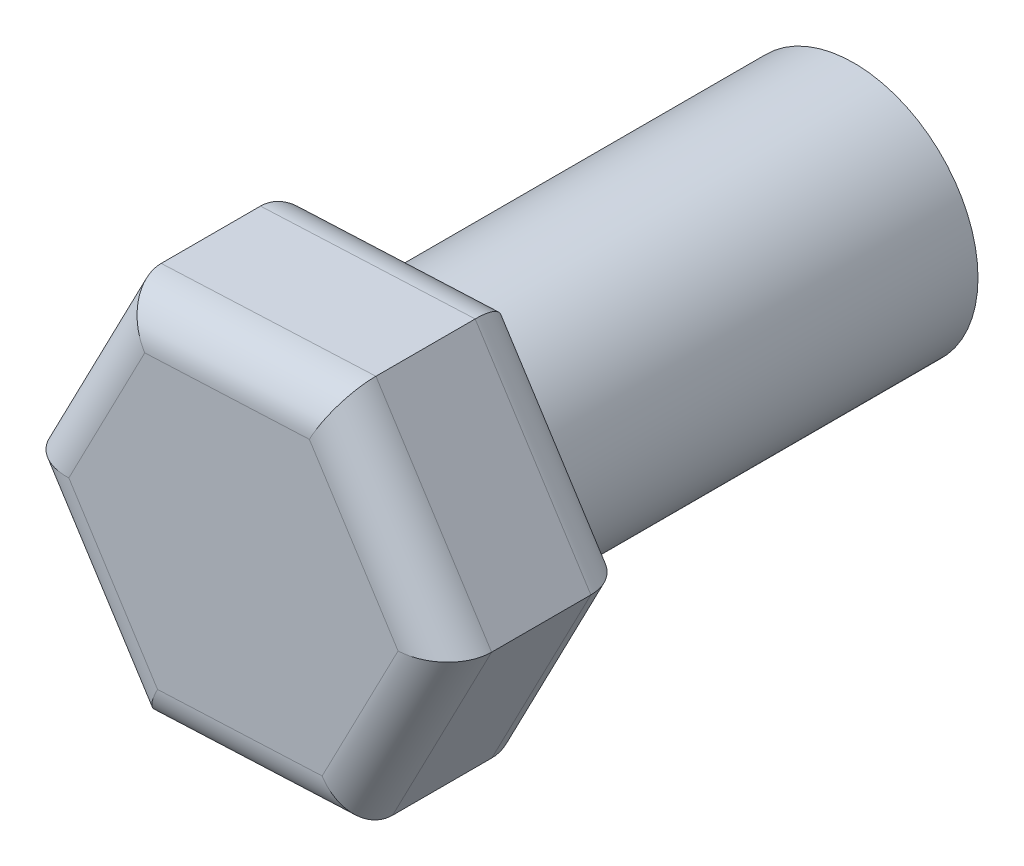
ISO-10303-21;
HEADER;
FILE_DESCRIPTION(('STEP AP214'),'2;1');
FILE_NAME('part.step','',(''),(''),'','','');
FILE_SCHEMA(('AUTOMOTIVE_DESIGN { 1 0 10303 214 1 1 1 1 }'));
ENDSEC;
DATA;
#1=APPLICATION_CONTEXT('core data for automotive mechanical design processes');
#2=APPLICATION_PROTOCOL_DEFINITION('international standard','automotive_design',2000,#1);
#3=PRODUCT_CONTEXT('',#1,'mechanical');
#4=PRODUCT('Part','Part','',(#3));
#5=PRODUCT_RELATED_PRODUCT_CATEGORY('part','',(#4));
#6=PRODUCT_DEFINITION_FORMATION('','',#4);
#7=PRODUCT_DEFINITION_CONTEXT('part definition',#1,'design');
#8=PRODUCT_DEFINITION('design','',#6,#7);
#9=PRODUCT_DEFINITION_SHAPE('','',#8);
#10=(LENGTH_UNIT() NAMED_UNIT(*) SI_UNIT(.MILLI.,.METRE.));
#11=(NAMED_UNIT(*) PLANE_ANGLE_UNIT() SI_UNIT($,.RADIAN.));
#12=(NAMED_UNIT(*) SI_UNIT($,.STERADIAN.) SOLID_ANGLE_UNIT());
#13=UNCERTAINTY_MEASURE_WITH_UNIT(LENGTH_MEASURE(1.E-05),#10,'distance_accuracy_value','');
#14=(GEOMETRIC_REPRESENTATION_CONTEXT(3) GLOBAL_UNCERTAINTY_ASSIGNED_CONTEXT((#13)) GLOBAL_UNIT_ASSIGNED_CONTEXT((#10,
#11,#12)) REPRESENTATION_CONTEXT('',''));
#15=CARTESIAN_POINT('',(0.,0.,0.));
#16=DIRECTION('',(0.,0.,1.));
#17=DIRECTION('',(1.,0.,0.));
#18=AXIS2_PLACEMENT_3D('',#15,#16,#17);
#19=CARTESIAN_POINT('',(0.,0.,7.));
#20=DIRECTION('',(0.,0.,-1.));
#21=DIRECTION('',(-1.,0.,0.));
#22=AXIS2_PLACEMENT_3D('',#19,#20,#21);
#23=CYLINDRICAL_SURFACE('',#22,2.);
#24=CARTESIAN_POINT('',(0.,0.,7.));
#25=DIRECTION('',(0.,0.,1.));
#26=DIRECTION('',(1.,0.,0.));
#27=AXIS2_PLACEMENT_3D('',#24,#25,#26);
#28=CIRCLE('',#27,2.);
#29=CARTESIAN_POINT('',(2.,0.,7.));
#30=VERTEX_POINT('',#29);
#31=EDGE_CURVE('E153',#30,#30,#28,.T.);
#32=ORIENTED_EDGE('',*,*,#31,.F.);
#33=EDGE_LOOP('',(#32));
#34=FACE_BOUND('',#33,.T.);
#35=CARTESIAN_POINT('',(0.,0.,0.));
#36=DIRECTION('',(0.,0.,1.));
#37=DIRECTION('',(1.,0.,0.));
#38=AXIS2_PLACEMENT_3D('',#35,#36,#37);
#39=CIRCLE('',#38,2.);
#40=CARTESIAN_POINT('',(2.,0.,0.));
#41=VERTEX_POINT('',#40);
#42=EDGE_CURVE('E222',#41,#41,#39,.T.);
#43=ORIENTED_EDGE('',*,*,#42,.T.);
#44=EDGE_LOOP('',(#43));
#45=FACE_BOUND('',#44,.T.);
#46=ADVANCED_FACE('F35',(#34,#45),#23,.T.);
#47=CARTESIAN_POINT('',(0.,0.,0.));
#48=DIRECTION('',(0.,0.,1.));
#49=DIRECTION('',(1.,0.,0.));
#50=AXIS2_PLACEMENT_3D('',#47,#48,#49);
#51=PLANE('',#50);
#52=ORIENTED_EDGE('',*,*,#42,.F.);
#53=EDGE_LOOP('',(#52));
#54=FACE_BOUND('',#53,.T.);
#55=ADVANCED_FACE('F302',(#54),#51,.F.);
#56=CARTESIAN_POINT('',(3.46062360564477,0.155191043730391,10.));
#57=DIRECTION('',(-0.842756003692805,-0.538295753503345,0.));
#58=DIRECTION('',(0.538295753503345,-0.842756003692805,0.));
#59=AXIS2_PLACEMENT_3D('',#56,#57,#58);
#60=PLANE('',#59);
#61=DIRECTION('',(0.,0.,-1.));
#62=VECTOR('',#61,1.);
#63=CARTESIAN_POINT('',(3.46062360564477,0.155191043730391,10.));
#64=LINE('',#63,#62);
#65=CARTESIAN_POINT('',(3.46062360564477,0.155191043730391,9.3));
#66=VERTEX_POINT('',#65);
#67=CARTESIAN_POINT('',(3.46062360564477,0.155191043730391,7.7));
#68=VERTEX_POINT('',#67);
#69=EDGE_CURVE('E170',#66,#68,#64,.T.);
#70=ORIENTED_EDGE('',*,*,#69,.T.);
#71=DIRECTION('',(-0.538295753503345,0.842756003692805,0.));
#72=VECTOR('',#71,1.);
#73=CARTESIAN_POINT('',(3.46062360564477,0.155191043730391,7.7));
#74=LINE('',#73,#72);
#75=CARTESIAN_POINT('',(1.59591241651204,3.07458347728967,7.7));
#76=VERTEX_POINT('',#75);
#77=EDGE_CURVE('E192',#68,#76,#74,.T.);
#78=ORIENTED_EDGE('',*,*,#77,.T.);
#79=DIRECTION('',(0.,0.,-1.));
#80=VECTOR('',#79,1.);
#81=CARTESIAN_POINT('',(1.59591241651204,3.07458347728967,10.));
#82=LINE('',#81,#80);
#83=CARTESIAN_POINT('',(1.59591241651204,3.07458347728967,9.3));
#84=VERTEX_POINT('',#83);
#85=EDGE_CURVE('E146',#84,#76,#82,.T.);
#86=ORIENTED_EDGE('',*,*,#85,.F.);
#87=DIRECTION('',(-0.538295753503345,0.842756003692805,0.));
#88=VECTOR('',#87,1.);
#89=CARTESIAN_POINT('',(3.46062360564477,0.155191043730391,9.3));
#90=LINE('',#89,#88);
#91=EDGE_CURVE('E194',#84,#66,#90,.F.);
#92=ORIENTED_EDGE('',*,*,#91,.T.);
#93=EDGE_LOOP('',(#70,#78,#86,#92));
#94=FACE_BOUND('',#93,.T.);
#95=ADVANCED_FACE('F239',(#94),#60,.F.);
#96=CARTESIAN_POINT('',(1.59591241651204,3.07458347728967,10.));
#97=DIRECTION('',(0.0447997954367808,-0.998995985141493,0.));
#98=DIRECTION('',(0.998995985141493,0.0447997954367808,0.));
#99=AXIS2_PLACEMENT_3D('',#96,#97,#98);
#100=PLANE('',#99);
#101=ORIENTED_EDGE('',*,*,#85,.T.);
#102=DIRECTION('',(-0.998995985141493,-0.0447997954367808,0.));
#103=VECTOR('',#102,1.);
#104=CARTESIAN_POINT('',(1.59591241651204,3.07458347728967,7.7));
#105=LINE('',#104,#103);
#106=CARTESIAN_POINT('',(-1.86471118913273,2.91939243355928,7.7));
#107=VERTEX_POINT('',#106);
#108=EDGE_CURVE('E145',#76,#107,#105,.T.);
#109=ORIENTED_EDGE('',*,*,#108,.T.);
#110=DIRECTION('',(0.,0.,-1.));
#111=VECTOR('',#110,1.);
#112=CARTESIAN_POINT('',(-1.86471118913273,2.91939243355928,10.));
#113=LINE('',#112,#111);
#114=CARTESIAN_POINT('',(-1.86471118913273,2.91939243355928,9.3));
#115=VERTEX_POINT('',#114);
#116=EDGE_CURVE('E128',#115,#107,#113,.T.);
#117=ORIENTED_EDGE('',*,*,#116,.F.);
#118=DIRECTION('',(-0.998995985141493,-0.0447997954367808,0.));
#119=VECTOR('',#118,1.);
#120=CARTESIAN_POINT('',(1.59591241651204,3.07458347728967,9.3));
#121=LINE('',#120,#119);
#122=EDGE_CURVE('E142',#115,#84,#121,.F.);
#123=ORIENTED_EDGE('',*,*,#122,.T.);
#124=EDGE_LOOP('',(#101,#109,#117,#123));
#125=FACE_BOUND('',#124,.T.);
#126=ADVANCED_FACE('F141',(#125),#100,.F.);
#127=CARTESIAN_POINT('',(-1.86471118913273,2.91939243355928,10.));
#128=DIRECTION('',(0.887555799129585,-0.460700231638149,0.));
#129=DIRECTION('',(0.460700231638149,0.887555799129585,0.));
#130=AXIS2_PLACEMENT_3D('',#127,#128,#129);
#131=PLANE('',#130);
#132=ORIENTED_EDGE('',*,*,#116,.T.);
#133=DIRECTION('',(-0.460700231638149,-0.887555799129585,0.));
#134=VECTOR('',#133,1.);
#135=CARTESIAN_POINT('',(-1.86471118913273,2.91939243355928,7.7));
#136=LINE('',#135,#134);
#137=CARTESIAN_POINT('',(-3.46062360564477,-0.155191043730384,7.7));
#138=VERTEX_POINT('',#137);
#139=EDGE_CURVE('E134',#107,#138,#136,.T.);
#140=ORIENTED_EDGE('',*,*,#139,.T.);
#141=DIRECTION('',(0.,0.,-1.));
#142=VECTOR('',#141,1.);
#143=CARTESIAN_POINT('',(-3.46062360564477,-0.155191043730384,10.));
#144=LINE('',#143,#142);
#145=CARTESIAN_POINT('',(-3.46062360564477,-0.155191043730384,9.3));
#146=VERTEX_POINT('',#145);
#147=EDGE_CURVE('E130',#146,#138,#144,.T.);
#148=ORIENTED_EDGE('',*,*,#147,.F.);
#149=DIRECTION('',(-0.460700231638149,-0.887555799129585,0.));
#150=VECTOR('',#149,1.);
#151=CARTESIAN_POINT('',(-1.86471118913273,2.91939243355928,9.3));
#152=LINE('',#151,#150);
#153=EDGE_CURVE('E125',#146,#115,#152,.F.);
#154=ORIENTED_EDGE('',*,*,#153,.T.);
#155=EDGE_LOOP('',(#132,#140,#148,#154));
#156=FACE_BOUND('',#155,.T.);
#157=ADVANCED_FACE('F127',(#156),#131,.F.);
#158=CARTESIAN_POINT('',(-3.46062360564477,-0.155191043730384,10.));
#159=DIRECTION('',(0.842756003692805,0.538295753503344,0.));
#160=DIRECTION('',(-0.538295753503344,0.842756003692805,0.));
#161=AXIS2_PLACEMENT_3D('',#158,#159,#160);
#162=PLANE('',#161);
#163=ORIENTED_EDGE('',*,*,#147,.T.);
#164=DIRECTION('',(0.538295753503344,-0.842756003692805,0.));
#165=VECTOR('',#164,1.);
#166=CARTESIAN_POINT('',(-3.46062360564477,-0.155191043730384,7.7));
#167=LINE('',#166,#165);
#168=CARTESIAN_POINT('',(-1.59591241651204,-3.07458347728967,7.7));
#169=VERTEX_POINT('',#168);
#170=EDGE_CURVE('E204',#138,#169,#167,.T.);
#171=ORIENTED_EDGE('',*,*,#170,.T.);
#172=DIRECTION('',(0.,0.,-1.));
#173=VECTOR('',#172,1.);
#174=CARTESIAN_POINT('',(-1.59591241651204,-3.07458347728967,10.));
#175=LINE('',#174,#173);
#176=CARTESIAN_POINT('',(-1.59591241651204,-3.07458347728967,9.3));
#177=VERTEX_POINT('',#176);
#178=EDGE_CURVE('E229',#177,#169,#175,.T.);
#179=ORIENTED_EDGE('',*,*,#178,.F.);
#180=DIRECTION('',(0.538295753503344,-0.842756003692805,0.));
#181=VECTOR('',#180,1.);
#182=CARTESIAN_POINT('',(-3.46062360564477,-0.155191043730384,9.3));
#183=LINE('',#182,#181);
#184=EDGE_CURVE('E206',#177,#146,#183,.F.);
#185=ORIENTED_EDGE('',*,*,#184,.T.);
#186=EDGE_LOOP('',(#163,#171,#179,#185));
#187=FACE_BOUND('',#186,.T.);
#188=ADVANCED_FACE('F263',(#187),#162,.F.);
#189=CARTESIAN_POINT('',(-1.59591241651204,-3.07458347728967,10.));
#190=DIRECTION('',(-0.0447997954367805,0.998995985141493,0.));
#191=DIRECTION('',(-0.998995985141493,-0.0447997954367805,0.));
#192=AXIS2_PLACEMENT_3D('',#189,#190,#191);
#193=PLANE('',#192);
#194=ORIENTED_EDGE('',*,*,#178,.T.);
#195=DIRECTION('',(0.998995985141493,0.0447997954367805,0.));
#196=VECTOR('',#195,1.);
#197=CARTESIAN_POINT('',(-1.59591241651204,-3.07458347728967,7.7));
#198=LINE('',#197,#196);
#199=CARTESIAN_POINT('',(1.86471118913273,-2.91939243355928,7.7));
#200=VERTEX_POINT('',#199);
#201=EDGE_CURVE('E200',#169,#200,#198,.T.);
#202=ORIENTED_EDGE('',*,*,#201,.T.);
#203=DIRECTION('',(0.,0.,-1.));
#204=VECTOR('',#203,1.);
#205=CARTESIAN_POINT('',(1.86471118913273,-2.91939243355928,10.));
#206=LINE('',#205,#204);
#207=CARTESIAN_POINT('',(1.86471118913273,-2.91939243355928,9.3));
#208=VERTEX_POINT('',#207);
#209=EDGE_CURVE('E232',#208,#200,#206,.T.);
#210=ORIENTED_EDGE('',*,*,#209,.F.);
#211=DIRECTION('',(0.998995985141493,0.0447997954367805,0.));
#212=VECTOR('',#211,1.);
#213=CARTESIAN_POINT('',(-1.59591241651204,-3.07458347728967,9.3));
#214=LINE('',#213,#212);
#215=EDGE_CURVE('E202',#208,#177,#214,.F.);
#216=ORIENTED_EDGE('',*,*,#215,.T.);
#217=EDGE_LOOP('',(#194,#202,#210,#216));
#218=FACE_BOUND('',#217,.T.);
#219=ADVANCED_FACE('F277',(#218),#193,.F.);
#220=CARTESIAN_POINT('',(1.86471118913273,-2.91939243355928,10.));
#221=DIRECTION('',(-0.887555799129585,0.460700231638149,0.));
#222=DIRECTION('',(-0.460700231638149,-0.887555799129585,0.));
#223=AXIS2_PLACEMENT_3D('',#220,#221,#222);
#224=PLANE('',#223);
#225=ORIENTED_EDGE('',*,*,#209,.T.);
#226=DIRECTION('',(0.460700231638149,0.887555799129585,0.));
#227=VECTOR('',#226,1.);
#228=CARTESIAN_POINT('',(1.86471118913273,-2.91939243355928,7.7));
#229=LINE('',#228,#227);
#230=EDGE_CURVE('E196',#200,#68,#229,.T.);
#231=ORIENTED_EDGE('',*,*,#230,.T.);
#232=ORIENTED_EDGE('',*,*,#69,.F.);
#233=DIRECTION('',(0.460700231638149,0.887555799129585,0.));
#234=VECTOR('',#233,1.);
#235=CARTESIAN_POINT('',(1.86471118913273,-2.91939243355928,9.3));
#236=LINE('',#235,#234);
#237=EDGE_CURVE('E198',#66,#208,#236,.F.);
#238=ORIENTED_EDGE('',*,*,#237,.T.);
#239=EDGE_LOOP('',(#225,#231,#232,#238));
#240=FACE_BOUND('',#239,.T.);
#241=ADVANCED_FACE('F279',(#240),#224,.F.);
#242=CARTESIAN_POINT('',(0.,0.,10.));
#243=DIRECTION('',(0.,0.,1.));
#244=DIRECTION('',(1.,0.,0.));
#245=AXIS2_PLACEMENT_3D('',#242,#243,#244);
#246=PLANE('',#245);
#247=DIRECTION('',(-0.460700231638149,-0.887555799129585,0.));
#248=VECTOR('',#247,1.);
#249=CARTESIAN_POINT('',(-2.83933454625406,-0.477681205877089,10.));
#250=LINE('',#249,#248);
#251=CARTESIAN_POINT('',(-1.42961191166842,2.23820086572878,10.));
#252=VERTEX_POINT('',#251);
#253=CARTESIAN_POINT('',(-2.65314476432766,-0.118979800193295,10.));
#254=VERTEX_POINT('',#253);
#255=EDGE_CURVE('E44',#252,#254,#250,.T.);
#256=ORIENTED_EDGE('',*,*,#255,.T.);
#257=DIRECTION('',(0.538295753503344,-0.842756003692805,0.));
#258=VECTOR('',#257,1.);
#259=CARTESIAN_POINT('',(-1.00598321392708,-2.69777644983733,10.));
#260=LINE('',#259,#258);
#261=CARTESIAN_POINT('',(-1.22353285265923,-2.35718066592208,10.));
#262=VERTEX_POINT('',#261);
#263=EDGE_CURVE('E11',#254,#262,#260,.T.);
#264=ORIENTED_EDGE('',*,*,#263,.T.);
#265=DIRECTION('',(0.998995985141493,0.0447997954367805,0.));
#266=VECTOR('',#265,1.);
#267=CARTESIAN_POINT('',(1.83335133232698,-2.22009524396023,10.));
#268=LINE('',#267,#266);
#269=CARTESIAN_POINT('',(1.42961191166842,-2.23820086572878,10.));
#270=VERTEX_POINT('',#269);
#271=EDGE_CURVE('E190',#262,#270,#268,.T.);
#272=ORIENTED_EDGE('',*,*,#271,.T.);
#273=DIRECTION('',(0.460700231638149,0.887555799129585,0.));
#274=VECTOR('',#273,1.);
#275=CARTESIAN_POINT('',(2.83933454625406,0.477681205877096,10.));
#276=LINE('',#275,#274);
#277=CARTESIAN_POINT('',(2.65314476432766,0.1189798001933,10.));
#278=VERTEX_POINT('',#277);
#279=EDGE_CURVE('E188',#270,#278,#276,.T.);
#280=ORIENTED_EDGE('',*,*,#279,.T.);
#281=DIRECTION('',(-0.538295753503345,0.842756003692805,0.));
#282=VECTOR('',#281,1.);
#283=CARTESIAN_POINT('',(1.00598321392708,2.69777644983733,10.));
#284=LINE('',#283,#282);
#285=CARTESIAN_POINT('',(1.22353285265923,2.35718066592208,10.));
#286=VERTEX_POINT('',#285);
#287=EDGE_CURVE('E186',#278,#286,#284,.T.);
#288=ORIENTED_EDGE('',*,*,#287,.T.);
#289=DIRECTION('',(-0.998995985141493,-0.0447997954367808,0.));
#290=VECTOR('',#289,1.);
#291=CARTESIAN_POINT('',(-1.83335133232698,2.22009524396023,10.));
#292=LINE('',#291,#290);
#293=EDGE_CURVE('E55',#286,#252,#292,.T.);
#294=ORIENTED_EDGE('',*,*,#293,.T.);
#295=EDGE_LOOP('',(#256,#264,#272,#280,#288,#294));
#296=FACE_BOUND('',#295,.T.);
#297=ADVANCED_FACE('F292',(#296),#246,.T.);
#298=CARTESIAN_POINT('',(0.,0.,7.));
#299=DIRECTION('',(0.,0.,1.));
#300=DIRECTION('',(1.,0.,0.));
#301=AXIS2_PLACEMENT_3D('',#298,#299,#300);
#302=PLANE('',#301);
#303=DIRECTION('',(-0.460700231638149,-0.887555799129585,0.));
#304=VECTOR('',#303,1.);
#305=CARTESIAN_POINT('',(-2.04137833799804,1.05961053276774,7.));
#306=LINE('',#305,#304);
#307=CARTESIAN_POINT('',(-2.65314476432766,-0.118979800193294,7.));
#308=VERTEX_POINT('',#307);
#309=CARTESIAN_POINT('',(-1.42961191166842,2.23820086572878,7.));
#310=VERTEX_POINT('',#309);
#311=EDGE_CURVE('E211',#308,#310,#306,.F.);
#312=ORIENTED_EDGE('',*,*,#311,.T.);
#313=DIRECTION('',(-0.998995985141493,-0.0447997954367808,0.));
#314=VECTOR('',#313,1.);
#315=CARTESIAN_POINT('',(-0.103039529504595,2.29769076582543,7.));
#316=LINE('',#315,#314);
#317=CARTESIAN_POINT('',(1.22353285265923,2.35718066592208,7.));
#318=VERTEX_POINT('',#317);
#319=EDGE_CURVE('E135',#310,#318,#316,.F.);
#320=ORIENTED_EDGE('',*,*,#319,.T.);
#321=DIRECTION('',(-0.538295753503345,0.842756003692805,0.));
#322=VECTOR('',#321,1.);
#323=CARTESIAN_POINT('',(1.93833880849344,1.23808023305769,7.));
#324=LINE('',#323,#322);
#325=CARTESIAN_POINT('',(2.65314476432766,0.1189798001933,7.));
#326=VERTEX_POINT('',#325);
#327=EDGE_CURVE('E219',#318,#326,#324,.F.);
#328=ORIENTED_EDGE('',*,*,#327,.T.);
#329=DIRECTION('',(0.460700231638149,0.887555799129585,0.));
#330=VECTOR('',#329,1.);
#331=CARTESIAN_POINT('',(2.04137833799804,-1.05961053276774,7.));
#332=LINE('',#331,#330);
#333=CARTESIAN_POINT('',(1.42961191166842,-2.23820086572878,7.));
#334=VERTEX_POINT('',#333);
#335=EDGE_CURVE('E217',#326,#334,#332,.F.);
#336=ORIENTED_EDGE('',*,*,#335,.T.);
#337=DIRECTION('',(0.998995985141493,0.0447997954367805,0.));
#338=VECTOR('',#337,1.);
#339=CARTESIAN_POINT('',(0.103039529504595,-2.29769076582543,7.));
#340=LINE('',#339,#338);
#341=CARTESIAN_POINT('',(-1.22353285265923,-2.35718066592208,7.));
#342=VERTEX_POINT('',#341);
#343=EDGE_CURVE('E215',#334,#342,#340,.F.);
#344=ORIENTED_EDGE('',*,*,#343,.T.);
#345=DIRECTION('',(0.538295753503344,-0.842756003692805,0.));
#346=VECTOR('',#345,1.);
#347=CARTESIAN_POINT('',(-1.93833880849344,-1.23808023305769,7.));
#348=LINE('',#347,#346);
#349=EDGE_CURVE('E213',#342,#308,#348,.F.);
#350=ORIENTED_EDGE('',*,*,#349,.T.);
#351=EDGE_LOOP('',(#312,#320,#328,#336,#344,#350));
#352=FACE_BOUND('',#351,.T.);
#353=ORIENTED_EDGE('',*,*,#31,.T.);
#354=EDGE_LOOP('',(#353));
#355=FACE_BOUND('',#354,.T.);
#356=ADVANCED_FACE('F324',(#352,#355),#302,.F.);
#357=CARTESIAN_POINT('',(-1.62727227331779,-2.37528628769062,7.7));
#358=DIRECTION('',(0.998995985141493,0.0447997954367805,0.));
#359=DIRECTION('',(-0.0447997954367805,0.998995985141493,0.));
#360=AXIS2_PLACEMENT_3D('',#357,#358,#359);
#361=CYLINDRICAL_SURFACE('',#360,0.7);
#362=CARTESIAN_POINT('',(-1.22353285265923,-2.35718066592208,7.7));
#363=DIRECTION('',(0.887555799129585,-0.460700231638149,0.));
#364=DIRECTION('',(0.460700231638149,0.887555799129585,0.));
#365=AXIS2_PLACEMENT_3D('',#362,#363,#364);
#366=ELLIPSE('',#365,0.808290376865476,0.7);
#367=EDGE_CURVE('E171',#342,#169,#366,.F.);
#368=ORIENTED_EDGE('',*,*,#367,.F.);
#369=ORIENTED_EDGE('',*,*,#343,.F.);
#370=CARTESIAN_POINT('',(1.42961191166842,-2.23820086572878,7.7));
#371=DIRECTION('',(0.842756003692805,0.538295753503345,0.));
#372=DIRECTION('',(-0.538295753503345,0.842756003692805,0.));
#373=AXIS2_PLACEMENT_3D('',#370,#371,#372);
#374=ELLIPSE('',#373,0.808290376865476,0.7);
#375=EDGE_CURVE('E167',#200,#334,#374,.T.);
#376=ORIENTED_EDGE('',*,*,#375,.F.);
#377=ORIENTED_EDGE('',*,*,#201,.F.);
#378=EDGE_LOOP('',(#368,#369,#376,#377));
#379=FACE_BOUND('',#378,.T.);
#380=ADVANCED_FACE('F273',(#379),#361,.T.);
#381=CARTESIAN_POINT('',(1.24342212974202,-2.59690227141257,7.7));
#382=DIRECTION('',(0.460700231638149,0.887555799129585,0.));
#383=DIRECTION('',(-0.887555799129585,0.460700231638149,0.));
#384=AXIS2_PLACEMENT_3D('',#381,#382,#383);
#385=CYLINDRICAL_SURFACE('',#384,0.7);
#386=ORIENTED_EDGE('',*,*,#375,.T.);
#387=ORIENTED_EDGE('',*,*,#335,.F.);
#388=CARTESIAN_POINT('',(2.65314476432766,0.1189798001933,7.7));
#389=DIRECTION('',(-0.0447997954367805,0.998995985141493,0.));
#390=DIRECTION('',(-0.998995985141493,-0.0447997954367804,0.));
#391=AXIS2_PLACEMENT_3D('',#388,#389,#390);
#392=ELLIPSE('',#391,0.808290376865476,0.7);
#393=EDGE_CURVE('E174',#68,#326,#392,.T.);
#394=ORIENTED_EDGE('',*,*,#393,.F.);
#395=ORIENTED_EDGE('',*,*,#230,.F.);
#396=EDGE_LOOP('',(#386,#387,#394,#395));
#397=FACE_BOUND('',#396,.T.);
#398=ADVANCED_FACE('F247',(#397),#385,.T.);
#399=CARTESIAN_POINT('',(-2.87069440305981,0.221615983721956,7.7));
#400=DIRECTION('',(0.538295753503344,-0.842756003692805,0.));
#401=DIRECTION('',(0.842756003692805,0.538295753503344,0.));
#402=AXIS2_PLACEMENT_3D('',#399,#400,#401);
#403=CYLINDRICAL_SURFACE('',#402,0.7);
#404=ORIENTED_EDGE('',*,*,#367,.T.);
#405=ORIENTED_EDGE('',*,*,#170,.F.);
#406=CARTESIAN_POINT('',(-2.65314476432766,-0.118979800193294,7.7));
#407=DIRECTION('',(0.0447997954367795,-0.998995985141493,0.));
#408=DIRECTION('',(0.998995985141493,0.0447997954367795,0.));
#409=AXIS2_PLACEMENT_3D('',#406,#407,#408);
#410=ELLIPSE('',#409,0.808290376865476,0.7);
#411=EDGE_CURVE('E177',#308,#138,#410,.F.);
#412=ORIENTED_EDGE('',*,*,#411,.F.);
#413=ORIENTED_EDGE('',*,*,#349,.F.);
#414=EDGE_LOOP('',(#404,#405,#412,#413));
#415=FACE_BOUND('',#414,.T.);
#416=ADVANCED_FACE('F267',(#415),#403,.T.);
#417=CARTESIAN_POINT('',(2.87069440305981,-0.22161598372195,7.7));
#418=DIRECTION('',(-0.538295753503345,0.842756003692805,0.));
#419=DIRECTION('',(-0.842756003692805,-0.538295753503345,0.));
#420=AXIS2_PLACEMENT_3D('',#417,#418,#419);
#421=CYLINDRICAL_SURFACE('',#420,0.7);
#422=ORIENTED_EDGE('',*,*,#393,.T.);
#423=ORIENTED_EDGE('',*,*,#327,.F.);
#424=CARTESIAN_POINT('',(1.22353285265923,2.35718066592208,7.7));
#425=DIRECTION('',(-0.887555799129585,0.460700231638148,0.));
#426=DIRECTION('',(0.460700231638148,0.887555799129585,0.));
#427=AXIS2_PLACEMENT_3D('',#424,#425,#426);
#428=ELLIPSE('',#427,0.808290376865476,0.7);
#429=EDGE_CURVE('E180',#76,#318,#428,.T.);
#430=ORIENTED_EDGE('',*,*,#429,.F.);
#431=ORIENTED_EDGE('',*,*,#77,.F.);
#432=EDGE_LOOP('',(#422,#423,#430,#431));
#433=FACE_BOUND('',#432,.T.);
#434=ADVANCED_FACE('F251',(#433),#421,.T.);
#435=CARTESIAN_POINT('',(-1.24342212974202,2.59690227141257,7.7));
#436=DIRECTION('',(-0.460700231638149,-0.887555799129585,0.));
#437=DIRECTION('',(0.887555799129585,-0.460700231638149,0.));
#438=AXIS2_PLACEMENT_3D('',#435,#436,#437);
#439=CYLINDRICAL_SURFACE('',#438,0.7);
#440=ORIENTED_EDGE('',*,*,#411,.T.);
#441=ORIENTED_EDGE('',*,*,#139,.F.);
#442=CARTESIAN_POINT('',(-1.42961191166842,2.23820086572878,7.7));
#443=DIRECTION('',(-0.842756003692805,-0.538295753503344,0.));
#444=DIRECTION('',(0.538295753503344,-0.842756003692805,0.));
#445=AXIS2_PLACEMENT_3D('',#442,#443,#444);
#446=ELLIPSE('',#445,0.808290376865476,0.7);
#447=EDGE_CURVE('E182',#310,#107,#446,.F.);
#448=ORIENTED_EDGE('',*,*,#447,.F.);
#449=ORIENTED_EDGE('',*,*,#311,.F.);
#450=EDGE_LOOP('',(#440,#441,#448,#449));
#451=FACE_BOUND('',#450,.T.);
#452=ADVANCED_FACE('F259',(#451),#439,.T.);
#453=CARTESIAN_POINT('',(1.62727227331779,2.37528628769062,7.7));
#454=DIRECTION('',(-0.998995985141493,-0.0447997954367808,0.));
#455=DIRECTION('',(0.0447997954367808,-0.998995985141493,0.));
#456=AXIS2_PLACEMENT_3D('',#453,#454,#455);
#457=CYLINDRICAL_SURFACE('',#456,0.7);
#458=ORIENTED_EDGE('',*,*,#429,.T.);
#459=ORIENTED_EDGE('',*,*,#319,.F.);
#460=ORIENTED_EDGE('',*,*,#447,.T.);
#461=ORIENTED_EDGE('',*,*,#108,.F.);
#462=EDGE_LOOP('',(#458,#459,#460,#461));
#463=FACE_BOUND('',#462,.T.);
#464=ADVANCED_FACE('F254',(#463),#457,.T.);
#465=CARTESIAN_POINT('',(1.93833880849344,1.23808023305769,9.3));
#466=DIRECTION('',(0.538295753503345,-0.842756003692805,0.));
#467=DIRECTION('',(0.842756003692805,0.538295753503345,0.));
#468=AXIS2_PLACEMENT_3D('',#465,#466,#467);
#469=CYLINDRICAL_SURFACE('',#468,0.7);
#470=CARTESIAN_POINT('',(2.65314476432766,0.118979800193299,9.3));
#471=DIRECTION('',(0.0447997954367805,-0.998995985141493,0.));
#472=DIRECTION('',(-0.998995985141493,-0.0447997954367804,0.));
#473=AXIS2_PLACEMENT_3D('',#470,#471,#472);
#474=ELLIPSE('',#473,0.808290376865476,0.7);
#475=EDGE_CURVE('E156',#66,#278,#474,.T.);
#476=ORIENTED_EDGE('',*,*,#475,.F.);
#477=ORIENTED_EDGE('',*,*,#91,.F.);
#478=CARTESIAN_POINT('',(1.22353285265923,2.35718066592208,9.3));
#479=DIRECTION('',(0.887555799129585,-0.460700231638148,0.));
#480=DIRECTION('',(-0.460700231638148,-0.887555799129585,0.));
#481=AXIS2_PLACEMENT_3D('',#478,#479,#480);
#482=ELLIPSE('',#481,0.808290376865476,0.7);
#483=EDGE_CURVE('E39',#286,#84,#482,.F.);
#484=ORIENTED_EDGE('',*,*,#483,.F.);
#485=ORIENTED_EDGE('',*,*,#287,.F.);
#486=EDGE_LOOP('',(#476,#477,#484,#485));
#487=FACE_BOUND('',#486,.T.);
#488=ADVANCED_FACE('F37',(#487),#469,.T.);
#489=CARTESIAN_POINT('',(-0.103039529504595,2.29769076582543,9.3));
#490=DIRECTION('',(0.998995985141493,0.0447997954367808,0.));
#491=DIRECTION('',(-0.0447997954367808,0.998995985141493,0.));
#492=AXIS2_PLACEMENT_3D('',#489,#490,#491);
#493=CYLINDRICAL_SURFACE('',#492,0.7);
#494=ORIENTED_EDGE('',*,*,#483,.T.);
#495=ORIENTED_EDGE('',*,*,#122,.F.);
#496=CARTESIAN_POINT('',(-1.42961191166842,2.23820086572878,9.3));
#497=DIRECTION('',(0.842756003692805,0.538295753503344,0.));
#498=DIRECTION('',(0.538295753503344,-0.842756003692805,0.));
#499=AXIS2_PLACEMENT_3D('',#496,#497,#498);
#500=ELLIPSE('',#499,0.808290376865476,0.7);
#501=EDGE_CURVE('E151',#252,#115,#500,.F.);
#502=ORIENTED_EDGE('',*,*,#501,.F.);
#503=ORIENTED_EDGE('',*,*,#293,.F.);
#504=EDGE_LOOP('',(#494,#495,#502,#503));
#505=FACE_BOUND('',#504,.T.);
#506=ADVANCED_FACE('F150',(#505),#493,.T.);
#507=CARTESIAN_POINT('',(2.04137833799804,-1.05961053276774,9.3));
#508=DIRECTION('',(-0.460700231638149,-0.887555799129585,0.));
#509=DIRECTION('',(0.887555799129585,-0.460700231638149,0.));
#510=AXIS2_PLACEMENT_3D('',#507,#508,#509);
#511=CYLINDRICAL_SURFACE('',#510,0.7);
#512=ORIENTED_EDGE('',*,*,#475,.T.);
#513=ORIENTED_EDGE('',*,*,#279,.F.);
#514=CARTESIAN_POINT('',(1.42961191166842,-2.23820086572878,9.3));
#515=DIRECTION('',(-0.842756003692805,-0.538295753503345,0.));
#516=DIRECTION('',(-0.538295753503345,0.842756003692805,0.));
#517=AXIS2_PLACEMENT_3D('',#514,#515,#516);
#518=ELLIPSE('',#517,0.808290376865476,0.7);
#519=EDGE_CURVE('E157',#208,#270,#518,.T.);
#520=ORIENTED_EDGE('',*,*,#519,.F.);
#521=ORIENTED_EDGE('',*,*,#237,.F.);
#522=EDGE_LOOP('',(#512,#513,#520,#521));
#523=FACE_BOUND('',#522,.T.);
#524=ADVANCED_FACE('F282',(#523),#511,.T.);
#525=CARTESIAN_POINT('',(-2.04137833799804,1.05961053276774,9.3));
#526=DIRECTION('',(0.460700231638149,0.887555799129585,0.));
#527=DIRECTION('',(-0.887555799129585,0.460700231638149,0.));
#528=AXIS2_PLACEMENT_3D('',#525,#526,#527);
#529=CYLINDRICAL_SURFACE('',#528,0.7);
#530=ORIENTED_EDGE('',*,*,#501,.T.);
#531=ORIENTED_EDGE('',*,*,#153,.F.);
#532=CARTESIAN_POINT('',(-2.65314476432766,-0.118979800193294,9.3));
#533=DIRECTION('',(-0.0447997954367795,0.998995985141493,0.));
#534=DIRECTION('',(0.998995985141493,0.0447997954367795,0.));
#535=AXIS2_PLACEMENT_3D('',#532,#533,#534);
#536=ELLIPSE('',#535,0.808290376865476,0.7);
#537=EDGE_CURVE('E161',#254,#146,#536,.F.);
#538=ORIENTED_EDGE('',*,*,#537,.F.);
#539=ORIENTED_EDGE('',*,*,#255,.F.);
#540=EDGE_LOOP('',(#530,#531,#538,#539));
#541=FACE_BOUND('',#540,.T.);
#542=ADVANCED_FACE('F155',(#541),#529,.T.);
#543=CARTESIAN_POINT('',(0.103039529504595,-2.29769076582543,9.3));
#544=DIRECTION('',(-0.998995985141493,-0.0447997954367805,0.));
#545=DIRECTION('',(0.0447997954367805,-0.998995985141493,0.));
#546=AXIS2_PLACEMENT_3D('',#543,#544,#545);
#547=CYLINDRICAL_SURFACE('',#546,0.7);
#548=ORIENTED_EDGE('',*,*,#519,.T.);
#549=ORIENTED_EDGE('',*,*,#271,.F.);
#550=CARTESIAN_POINT('',(-1.22353285265923,-2.35718066592208,9.3));
#551=DIRECTION('',(-0.887555799129585,0.460700231638149,0.));
#552=DIRECTION('',(-0.460700231638149,-0.887555799129585,0.));
#553=AXIS2_PLACEMENT_3D('',#550,#551,#552);
#554=ELLIPSE('',#553,0.808290376865476,0.7);
#555=EDGE_CURVE('E165',#177,#262,#554,.T.);
#556=ORIENTED_EDGE('',*,*,#555,.F.);
#557=ORIENTED_EDGE('',*,*,#215,.F.);
#558=EDGE_LOOP('',(#548,#549,#556,#557));
#559=FACE_BOUND('',#558,.T.);
#560=ADVANCED_FACE('F288',(#559),#547,.T.);
#561=CARTESIAN_POINT('',(-1.93833880849344,-1.23808023305769,9.3));
#562=DIRECTION('',(-0.538295753503344,0.842756003692805,0.));
#563=DIRECTION('',(-0.842756003692805,-0.538295753503344,0.));
#564=AXIS2_PLACEMENT_3D('',#561,#562,#563);
#565=CYLINDRICAL_SURFACE('',#564,0.7);
#566=ORIENTED_EDGE('',*,*,#537,.T.);
#567=ORIENTED_EDGE('',*,*,#184,.F.);
#568=ORIENTED_EDGE('',*,*,#555,.T.);
#569=ORIENTED_EDGE('',*,*,#263,.F.);
#570=EDGE_LOOP('',(#566,#567,#568,#569));
#571=FACE_BOUND('',#570,.T.);
#572=ADVANCED_FACE('F290',(#571),#565,.T.);
#573=CLOSED_SHELL('',(#46,#55,#95,#126,#157,#188,#219,#241,#297,#356,#380,#398,#416,#434,#452,
#464,#488,#506,#524,#542,#560,#572));
#574=MANIFOLD_SOLID_BREP('B2',#573);
#575=ADVANCED_BREP_SHAPE_REPRESENTATION('',(#18,#574),#14);
#576=SHAPE_DEFINITION_REPRESENTATION(#9,#575);
ENDSEC;
END-ISO-10303-21;
